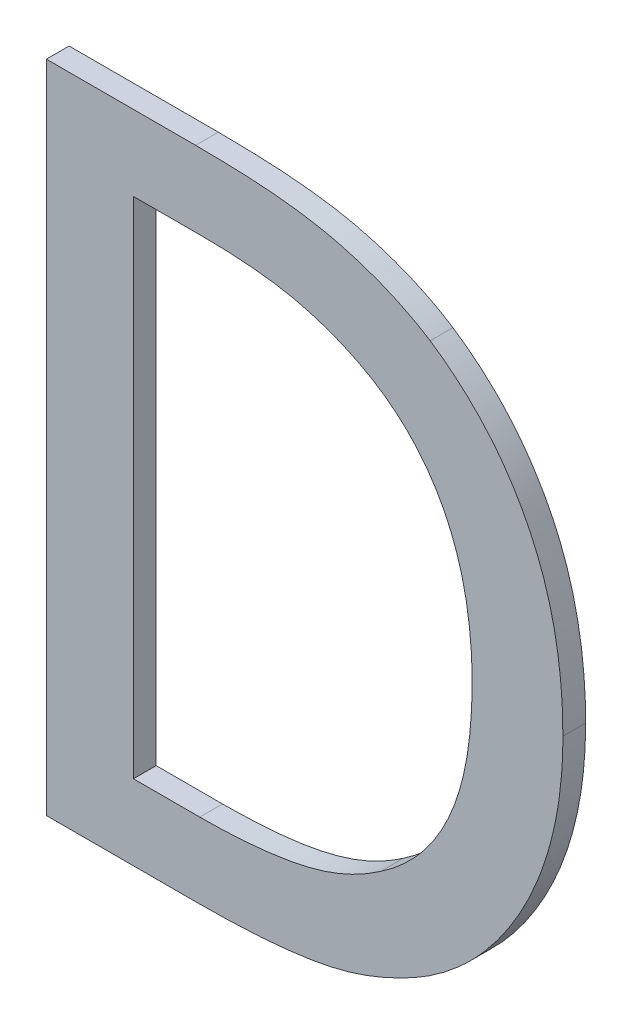
ISO-10303-21;
HEADER;
FILE_DESCRIPTION(('STEP AP214'),'2;1');
FILE_NAME('part.step','',(''),(''),'','','');
FILE_SCHEMA(('AUTOMOTIVE_DESIGN { 1 0 10303 214 1 1 1 1 }'));
ENDSEC;
DATA;
#1=APPLICATION_CONTEXT('core data for automotive mechanical design processes');
#2=APPLICATION_PROTOCOL_DEFINITION('international standard','automotive_design',2000,#1);
#3=PRODUCT_CONTEXT('',#1,'mechanical');
#4=PRODUCT('Part','Part','',(#3));
#5=PRODUCT_RELATED_PRODUCT_CATEGORY('part','',(#4));
#6=PRODUCT_DEFINITION_FORMATION('','',#4);
#7=PRODUCT_DEFINITION_CONTEXT('part definition',#1,'design');
#8=PRODUCT_DEFINITION('design','',#6,#7);
#9=PRODUCT_DEFINITION_SHAPE('','',#8);
#10=(LENGTH_UNIT() NAMED_UNIT(*) SI_UNIT(.MILLI.,.METRE.));
#11=(NAMED_UNIT(*) PLANE_ANGLE_UNIT() SI_UNIT($,.RADIAN.));
#12=(NAMED_UNIT(*) SI_UNIT($,.STERADIAN.) SOLID_ANGLE_UNIT());
#13=UNCERTAINTY_MEASURE_WITH_UNIT(LENGTH_MEASURE(1.E-05),#10,'distance_accuracy_value','');
#14=(GEOMETRIC_REPRESENTATION_CONTEXT(3) GLOBAL_UNCERTAINTY_ASSIGNED_CONTEXT((#13)) GLOBAL_UNIT_ASSIGNED_CONTEXT((#10,
#11,#12)) REPRESENTATION_CONTEXT('',''));
#15=CARTESIAN_POINT('',(0.,0.,0.));
#16=DIRECTION('',(0.,0.,1.));
#17=DIRECTION('',(1.,0.,0.));
#18=AXIS2_PLACEMENT_3D('',#15,#16,#17);
#19=CARTESIAN_POINT('',(-1.13140049899988,-1.31839189230399,0.0042));
#20=DIRECTION('',(0.,0.,1.));
#21=DIRECTION('',(1.,0.,0.));
#22=AXIS2_PLACEMENT_3D('',#19,#20,#21);
#23=PLANE('',#22);
#24=CARTESIAN_POINT('',(-1.10301730747266,-1.35955192614825,0.0042));
#25=CARTESIAN_POINT('',(-1.09960235289576,-1.35729888949205,0.0042));
#26=CARTESIAN_POINT('',(-1.09659369860559,-1.35452542417896,0.0042));
#27=CARTESIAN_POINT('',(-1.09117427078149,-1.34791884180105,0.0042));
#28=CARTESIAN_POINT('',(-1.08886084613736,-1.34400450014259,0.0042));
#29=CARTESIAN_POINT('',(-1.08516833311592,-1.33521081154436,0.0042));
#30=CARTESIAN_POINT('',(-1.08393591014188,-1.3302720120489,0.0042));
#31=CARTESIAN_POINT('',(-1.0831140908516,-1.32301760150182,0.0042));
#32=CARTESIAN_POINT('',(-1.08299402692732,-1.32075138212531,0.0042));
#33=CARTESIAN_POINT('',(-1.08300434203172,-1.31849357860533,0.0042));
#34=B_SPLINE_CURVE_WITH_KNOTS('',3,(#24,#25,#26,#27,#28,#29,#30,#31,#32,#33),.UNSPECIFIED.,.F.,
.F.,(4,2,2,2,4),(0.,0.0121483247201117,0.0255860257724383,0.0406473485388404,0.047434827382608),.UNSPECIFIED.);
#35=CARTESIAN_POINT('',(-1.10301730747266,-1.35955192614825,0.0042));
#36=VERTEX_POINT('',#35);
#37=CARTESIAN_POINT('',(-1.08300434203172,-1.31849358038251,0.0042));
#38=VERTEX_POINT('',#37);
#39=EDGE_CURVE('E11',#36,#38,#34,.T.);
#40=ORIENTED_EDGE('',*,*,#39,.T.);
#41=CARTESIAN_POINT('',(-1.08300434203172,-1.31849358038251,0.0042));
#42=CARTESIAN_POINT('',(-1.08300982933336,-1.31558404365748,0.0042));
#43=CARTESIAN_POINT('',(-1.08316865375619,-1.31265959893963,0.0042));
#44=CARTESIAN_POINT('',(-1.08390324457186,-1.30685151311761,0.0042));
#45=CARTESIAN_POINT('',(-1.08448109847194,-1.3039681502848,0.0042));
#46=CARTESIAN_POINT('',(-1.08659467127721,-1.29691345012609,0.0042));
#47=CARTESIAN_POINT('',(-1.08846808725424,-1.29283291179868,0.0042));
#48=CARTESIAN_POINT('',(-1.09322256029744,-1.28566720024031,0.0042));
#49=CARTESIAN_POINT('',(-1.09603296293457,-1.28253561646582,0.0042));
#50=CARTESIAN_POINT('',(-1.1003891642201,-1.27892416111204,0.0042));
#51=CARTESIAN_POINT('',(-1.10160144533238,-1.27802509561075,0.0042));
#52=CARTESIAN_POINT('',(-1.10285847447021,-1.2771969849906,0.0042));
#53=B_SPLINE_CURVE_WITH_KNOTS('',3,(#41,#42,#43,#44,#45,#46,#47,#48,#49,#50,#51,#52),
.UNSPECIFIED.,.F.,.F.,(4,2,2,2,2,4),(0.,0.00874687254746836,0.0175376219848716,
0.0307994104116767,0.0432285066677304,0.0477472718789346),.UNSPECIFIED.);
#54=CARTESIAN_POINT('',(-1.1028584744136,-1.27719698502818,0.0042));
#55=VERTEX_POINT('',#54);
#56=EDGE_CURVE('E138',#38,#55,#53,.T.);
#57=ORIENTED_EDGE('',*,*,#56,.T.);
#58=CARTESIAN_POINT('',(-1.1028584744136,-1.27719698502818,0.0042));
#59=CARTESIAN_POINT('',(-1.10575896532914,-1.2753338488799,0.0042));
#60=CARTESIAN_POINT('',(-1.10887155015735,-1.27386765144865,0.0042));
#61=CARTESIAN_POINT('',(-1.11500161855721,-1.27173618957782,0.0042));
#62=CARTESIAN_POINT('',(-1.11799509444407,-1.27100327847368,0.0042));
#63=CARTESIAN_POINT('',(-1.1243818689548,-1.26995110489897,0.0042));
#64=CARTESIAN_POINT('',(-1.1277826761789,-1.26968676389934,0.0042));
#65=CARTESIAN_POINT('',(-1.13344695278662,-1.26946475473684,0.0042));
#66=CARTESIAN_POINT('',(-1.13570787886852,-1.26943380337388,0.0042));
#67=CARTESIAN_POINT('',(-1.13796058046478,-1.26941416513448,0.0042));
#68=B_SPLINE_CURVE_WITH_KNOTS('',3,(#58,#59,#60,#61,#62,#63,#64,#65,#66,#67),.UNSPECIFIED.,.F.,
.F.,(4,2,2,2,4),(0.,0.010263633500949,0.0194555388350048,0.0296673672654124,0.0364413513656691),.UNSPECIFIED.);
#69=CARTESIAN_POINT('',(-1.13796058046478,-1.26941416513448,0.0042));
#70=VERTEX_POINT('',#69);
#71=EDGE_CURVE('E270',#55,#70,#68,.T.);
#72=ORIENTED_EDGE('',*,*,#71,.T.);
#73=DIRECTION('',(-1.,0.,0.));
#74=VECTOR('',#73,1.);
#75=CARTESIAN_POINT('',(-1.13796058046478,-1.26941416513448,0.0042));
#76=LINE('',#75,#74);
#77=CARTESIAN_POINT('',(-1.16027662526202,-1.26941416513448,0.0042));
#78=VERTEX_POINT('',#77);
#79=EDGE_CURVE('E262',#70,#78,#76,.T.);
#80=ORIENTED_EDGE('',*,*,#79,.T.);
#81=DIRECTION('',(0.,-1.,0.));
#82=VECTOR('',#81,1.);
#83=CARTESIAN_POINT('',(-1.16027662526202,-1.26941416513448,0.0042));
#84=LINE('',#83,#82);
#85=CARTESIAN_POINT('',(-1.16027662526202,-1.36741416257148,0.0042));
#86=VERTEX_POINT('',#85);
#87=EDGE_CURVE('E327',#78,#86,#84,.T.);
#88=ORIENTED_EDGE('',*,*,#87,.T.);
#89=DIRECTION('',(1.,0.,0.));
#90=VECTOR('',#89,1.);
#91=CARTESIAN_POINT('',(-1.16027662526202,-1.36741416257148,0.0042));
#92=LINE('',#91,#90);
#93=CARTESIAN_POINT('',(-1.1377223308762,-1.36741416257148,0.0042));
#94=VERTEX_POINT('',#93);
#95=EDGE_CURVE('E335',#86,#94,#92,.T.);
#96=ORIENTED_EDGE('',*,*,#95,.T.);
#97=CARTESIAN_POINT('',(-1.1377223308762,-1.36741416257148,0.0042));
#98=CARTESIAN_POINT('',(-1.13500817967669,-1.36740371898884,0.0042));
#99=CARTESIAN_POINT('',(-1.13228524834509,-1.36735083765665,0.0042));
#100=CARTESIAN_POINT('',(-1.12684049036077,-1.36705099203876,0.0042));
#101=CARTESIAN_POINT('',(-1.12411871154517,-1.36680325352465,0.0042));
#102=CARTESIAN_POINT('',(-1.12027061528457,-1.36623303358368,0.0042));
#103=CARTESIAN_POINT('',(-1.11912711970572,-1.36603551380033,0.0042));
#104=CARTESIAN_POINT('',(-1.11727488370886,-1.36564071016203,0.0042));
#105=CARTESIAN_POINT('',(-1.11656058339052,-1.36546993593813,0.0042));
#106=CARTESIAN_POINT('',(-1.11503159663148,-1.36505960509416,0.0042));
#107=CARTESIAN_POINT('',(-1.11421867382135,-1.36481346926531,0.0042));
#108=CARTESIAN_POINT('',(-1.11176310505891,-1.36398964451947,0.0042));
#109=CARTESIAN_POINT('',(-1.11014608236842,-1.36333531324551,0.0042));
#110=CARTESIAN_POINT('',(-1.10665639527216,-1.36169802475253,0.0042));
#111=CARTESIAN_POINT('',(-1.10480235242511,-1.36067479026885,0.0042));
#112=CARTESIAN_POINT('',(-1.10301730746953,-1.35955192614628,0.0042));
#113=B_SPLINE_CURVE_WITH_KNOTS('',3,(#97,#98,#99,#100,#101,#102,#103,#104,#105,#106,#107,#108,
#109,#110,#111,#112),.UNSPECIFIED.,.F.,.F.,(4,2,2,2,2,2,2,4),(0.,0.00815681662447947,
0.0163462075588577,0.0198249701318982,0.022027207716926,0.0245737239404821,0.0297957794660066,
0.036126634845621),.UNSPECIFIED.);
#114=EDGE_CURVE('E379',#94,#36,#113,.T.);
#115=ORIENTED_EDGE('',*,*,#114,.T.);
#116=EDGE_LOOP('',(#40,#57,#72,#80,#88,#96,#115));
#117=FACE_BOUND('',#116,.T.);
#118=CARTESIAN_POINT('',(-1.11024421165967,-1.34962485995731,0.0042));
#119=CARTESIAN_POINT('',(-1.11157203534654,-1.35055736590895,0.0042));
#120=CARTESIAN_POINT('',(-1.11297341778274,-1.35138748820357,0.0042));
#121=CARTESIAN_POINT('',(-1.1158648797809,-1.35281318705049,0.0042));
#122=CARTESIAN_POINT('',(-1.1173533354089,-1.35341205991404,0.0042));
#123=CARTESIAN_POINT('',(-1.12063043563334,-1.3544462784535,0.0042));
#124=CARTESIAN_POINT('',(-1.12243064896194,-1.35484369238719,0.0042));
#125=CARTESIAN_POINT('',(-1.12606463026105,-1.35546234714417,0.0042));
#126=CARTESIAN_POINT('',(-1.12789851434755,-1.3556827706722,0.0042));
#127=CARTESIAN_POINT('',(-1.13100422670817,-1.35594349247601,0.0042));
#128=CARTESIAN_POINT('',(-1.13227321979143,-1.35601850934008,0.0042));
#129=CARTESIAN_POINT('',(-1.13480338399338,-1.35611495032586,0.0042));
#130=CARTESIAN_POINT('',(-1.13606453884867,-1.35613678820967,0.0042));
#131=CARTESIAN_POINT('',(-1.13732524822856,-1.35613701537857,0.0042));
#132=B_SPLINE_CURVE_WITH_KNOTS('',3,(#118,#119,#120,#121,#122,#123,#124,#125,#126,#127,#128,
#129,#130,#131),.UNSPECIFIED.,.F.,.F.,(4,2,2,2,2,2,4),(0.,0.0048656758365212,
0.00965918058658374,0.0151707053628846,0.0207075368628053,0.0245199346406423,0.028302573698393),.UNSPECIFIED.);
#133=CARTESIAN_POINT('',(-1.11024421165967,-1.34962485995731,0.0042));
#134=VERTEX_POINT('',#133);
#135=CARTESIAN_POINT('',(-1.13732524822856,-1.35613701537857,0.0042));
#136=VERTEX_POINT('',#135);
#137=EDGE_CURVE('E222',#134,#136,#132,.T.);
#138=ORIENTED_EDGE('',*,*,#137,.T.);
#139=DIRECTION('',(-1.,0.,0.));
#140=VECTOR('',#139,1.);
#141=CARTESIAN_POINT('',(-1.13732524822856,-1.35613701537857,0.0042));
#142=LINE('',#141,#140);
#143=CARTESIAN_POINT('',(-1.14725231441951,-1.35613701537857,0.0042));
#144=VERTEX_POINT('',#143);
#145=EDGE_CURVE('E269',#136,#144,#142,.T.);
#146=ORIENTED_EDGE('',*,*,#145,.T.);
#147=DIRECTION('',(0.,1.,0.));
#148=VECTOR('',#147,1.);
#149=CARTESIAN_POINT('',(-1.14725231441951,-1.35613701537857,0.0042));
#150=LINE('',#149,#148);
#151=CARTESIAN_POINT('',(-1.14725231441951,-1.28069131232739,0.0042));
#152=VERTEX_POINT('',#151);
#153=EDGE_CURVE('E319',#144,#152,#150,.T.);
#154=ORIENTED_EDGE('',*,*,#153,.T.);
#155=DIRECTION('',(1.,0.,0.));
#156=VECTOR('',#155,1.);
#157=CARTESIAN_POINT('',(-1.14725231441951,-1.28069131232739,0.0042));
#158=LINE('',#157,#156);
#159=CARTESIAN_POINT('',(-1.13732524822856,-1.28069131232739,0.0042));
#160=VERTEX_POINT('',#159);
#161=EDGE_CURVE('E329',#152,#160,#158,.T.);
#162=ORIENTED_EDGE('',*,*,#161,.T.);
#163=CARTESIAN_POINT('',(-1.13732524822856,-1.28069131232739,0.0042));
#164=CARTESIAN_POINT('',(-1.13521678352764,-1.28070898737483,0.0042));
#165=CARTESIAN_POINT('',(-1.13309745103266,-1.28075684530196,0.0042));
#166=CARTESIAN_POINT('',(-1.12886194601626,-1.28103600808401,0.0042));
#167=CARTESIAN_POINT('',(-1.12674584356322,-1.28126823858898,0.0042));
#168=CARTESIAN_POINT('',(-1.1221872235976,-1.28211115314495,0.0042));
#169=CARTESIAN_POINT('',(-1.11975453554178,-1.28278244976374,0.0042));
#170=CARTESIAN_POINT('',(-1.11533840040602,-1.28446528614556,0.0042));
#171=CARTESIAN_POINT('',(-1.1133358164328,-1.28542732691544,0.0042));
#172=CARTESIAN_POINT('',(-1.11143545960227,-1.28656813551261,0.0042));
#173=B_SPLINE_CURVE_WITH_KNOTS('',3,(#163,#164,#165,#166,#167,#168,#169,#170,#171,#172),
.UNSPECIFIED.,.F.,.F.,(4,2,2,2,4),(0.,0.00634351880858543,0.0127190884594158,0.0202425892854986,
0.026878269218333),.UNSPECIFIED.);
#174=CARTESIAN_POINT('',(-1.11143545960258,-1.28656813551243,0.0042));
#175=VERTEX_POINT('',#174);
#176=EDGE_CURVE('E336',#160,#175,#173,.T.);
#177=ORIENTED_EDGE('',*,*,#176,.T.);
#178=CARTESIAN_POINT('',(-1.11143545960258,-1.28656813551243,0.0042));
#179=CARTESIAN_POINT('',(-1.11016657004239,-1.28734298316421,0.0042));
#180=CARTESIAN_POINT('',(-1.10895601342185,-1.28821401576167,0.0042));
#181=CARTESIAN_POINT('',(-1.10668936589985,-1.29012942543853,0.0042));
#182=CARTESIAN_POINT('',(-1.10563268789603,-1.29117310937606,0.0042));
#183=CARTESIAN_POINT('',(-1.10277546676278,-1.29449842369174,0.0042));
#184=CARTESIAN_POINT('',(-1.10123266831576,-1.29700780232448,0.0042));
#185=CARTESIAN_POINT('',(-1.09868703353264,-1.30272181808107,0.0042));
#186=CARTESIAN_POINT('',(-1.09780232662253,-1.30597412992284,0.0042));
#187=CARTESIAN_POINT('',(-1.09678430121129,-1.31228636596024,0.0042));
#188=CARTESIAN_POINT('',(-1.09658807239371,-1.31533556753005,0.0042));
#189=CARTESIAN_POINT('',(-1.09658456858093,-1.31833474732345,0.0042));
#190=B_SPLINE_CURVE_WITH_KNOTS('',3,(#178,#179,#180,#181,#182,#183,#184,#185,#186,#187,#188,
#189),.UNSPECIFIED.,.F.,.F.,(4,2,2,2,2,4),(0.,0.00445608065663681,0.00889468737193858,
0.0175875109740678,0.0276051771161479,0.0366795200492553),.UNSPECIFIED.);
#191=CARTESIAN_POINT('',(-1.09658456858093,-1.31833474732345,0.0042));
#192=VERTEX_POINT('',#191);
#193=EDGE_CURVE('E373',#175,#192,#190,.T.);
#194=ORIENTED_EDGE('',*,*,#193,.T.);
#195=CARTESIAN_POINT('',(-1.09658456858093,-1.31833474732345,0.0042));
#196=CARTESIAN_POINT('',(-1.09659541853067,-1.32063320012037,0.0042));
#197=CARTESIAN_POINT('',(-1.09669148673753,-1.322943179593,0.0042));
#198=CARTESIAN_POINT('',(-1.0971745817959,-1.32756140107349,0.0042));
#199=CARTESIAN_POINT('',(-1.09756551270803,-1.32986920004738,0.0042));
#200=CARTESIAN_POINT('',(-1.09895886146249,-1.33512444451162,0.0042));
#201=CARTESIAN_POINT('',(-1.10011808872536,-1.33803752473386,0.0042));
#202=CARTESIAN_POINT('',(-1.10315327981692,-1.34306488749063,0.0042));
#203=CARTESIAN_POINT('',(-1.10494127230031,-1.34523091410798,0.0042));
#204=CARTESIAN_POINT('',(-1.10801661762171,-1.34801516405458,0.0042));
#205=CARTESIAN_POINT('',(-1.10910286080375,-1.34886363896521,0.0042));
#206=CARTESIAN_POINT('',(-1.11024421171022,-1.3496248599914,0.0042));
#207=B_SPLINE_CURVE_WITH_KNOTS('',3,(#195,#196,#197,#198,#199,#200,#201,#202,#203,#204,#205,
#206),.UNSPECIFIED.,.F.,.F.,(4,2,2,2,2,4),(0.,0.00691079574746498,0.0139147345152009,
0.0231825961663285,0.0314779740292851,0.0355972436315414),.UNSPECIFIED.);
#208=EDGE_CURVE('E253',#192,#134,#207,.T.);
#209=ORIENTED_EDGE('',*,*,#208,.T.);
#210=EDGE_LOOP('',(#138,#146,#154,#162,#177,#194,#209));
#211=FACE_BOUND('',#210,.T.);
#212=ADVANCED_FACE('F17',(#117,#211),#23,.T.);
#213=CARTESIAN_POINT('',(-1.11024421165967,-1.34962485995731,0.0008));
#214=CARTESIAN_POINT('',(-1.11024421165967,-1.34962485995731,0.0042));
#215=CARTESIAN_POINT('',(-1.1034143901203,-1.34501870124471,0.0008));
#216=CARTESIAN_POINT('',(-1.1034143901203,-1.34501870124471,0.0042));
#217=CARTESIAN_POINT('',(-1.09658456858093,-1.32977072757542,0.0008));
#218=CARTESIAN_POINT('',(-1.09658456858093,-1.32977072757542,0.0042));
#219=CARTESIAN_POINT('',(-1.09658456858093,-1.31833474732345,0.0008));
#220=CARTESIAN_POINT('',(-1.09658456858093,-1.31833474732345,0.0042));
#221=B_SPLINE_SURFACE_WITH_KNOTS('',2,1,((#213,#214),(#215,#216),(#217,#218),(#219,#220)),
.UNSPECIFIED.,.F.,.F.,.F.,(3,1,3),(2,2),(0.,0.5,1.),(0.,1.),.UNSPECIFIED.);
#222=CARTESIAN_POINT('',(-1.11024421165967,-1.34962485995731,0.0008));
#223=CARTESIAN_POINT('',(-1.10901210354309,-1.34879731583163,0.0008));
#224=CARTESIAN_POINT('',(-1.10784348992091,-1.34787608623182,0.0008));
#225=CARTESIAN_POINT('',(-1.1056665424074,-1.34586693353079,0.0008));
#226=CARTESIAN_POINT('',(-1.10465773000568,-1.34477952800885,0.0008));
#227=CARTESIAN_POINT('',(-1.10195272590175,-1.34134486653136,0.0008));
#228=CARTESIAN_POINT('',(-1.1005178647497,-1.33878468994247,0.0008));
#229=CARTESIAN_POINT('',(-1.09829789677024,-1.33317723537789,0.0008));
#230=CARTESIAN_POINT('',(-1.09757768121166,-1.3301070936118,0.0008));
#231=CARTESIAN_POINT('',(-1.09675011153146,-1.3241155646116,0.0008));
#232=CARTESIAN_POINT('',(-1.09660045448235,-1.32120053299536,0.0008));
#233=CARTESIAN_POINT('',(-1.09658456858093,-1.31833474732345,0.0008));
#234=B_SPLINE_CURVE_WITH_KNOTS('',3,(#222,#223,#224,#225,#226,#227,#228,#229,#230,#231,#232,
#233),.UNSPECIFIED.,.F.,.F.,(4,2,2,2,2,4),(0.,0.00444696525724402,0.00888035193201221,
0.0175394397206024,0.0269277130966965,0.0356046138722512),.UNSPECIFIED.);
#235=CARTESIAN_POINT('',(-1.11024421165967,-1.34962485995731,0.0008));
#236=VERTEX_POINT('',#235);
#237=CARTESIAN_POINT('',(-1.09658456858093,-1.31833474732345,0.0008));
#238=VERTEX_POINT('',#237);
#239=EDGE_CURVE('E30',#236,#238,#234,.T.);
#240=DIRECTION('',(0.,0.,1.));
#241=VECTOR('',#240,1.);
#242=CARTESIAN_POINT('',(-1.11024421165967,-1.34962485995731,0.0008));
#243=LINE('',#242,#241);
#244=EDGE_CURVE('E223',#236,#134,#243,.T.);
#245=DIRECTION('',(0.,0.,1.));
#246=VECTOR('',#245,1.);
#247=CARTESIAN_POINT('',(-1.09658456858093,-1.31833474732345,0.0008));
#248=LINE('',#247,#246);
#249=EDGE_CURVE('E316',#238,#192,#248,.T.);
#250=ORIENTED_EDGE('',*,*,#239,.F.);
#251=ORIENTED_EDGE('',*,*,#244,.T.);
#252=ORIENTED_EDGE('',*,*,#208,.F.);
#253=ORIENTED_EDGE('',*,*,#249,.F.);
#254=EDGE_LOOP('',(#250,#251,#252,#253));
#255=FACE_BOUND('',#254,.T.);
#256=ADVANCED_FACE('F238',(#255),#221,.F.);
#257=CARTESIAN_POINT('',(-1.13732524822856,-1.35613701537857,0.0008));
#258=CARTESIAN_POINT('',(-1.13732524822856,-1.35613701537857,0.0042));
#259=CARTESIAN_POINT('',(-1.12866884651006,-1.35613701537857,0.0008));
#260=CARTESIAN_POINT('',(-1.12866884651006,-1.35613701537857,0.0042));
#261=CARTESIAN_POINT('',(-1.11556511913801,-1.3533574368451,0.0008));
#262=CARTESIAN_POINT('',(-1.11556511913801,-1.3533574368451,0.0042));
#263=CARTESIAN_POINT('',(-1.11024421165967,-1.34962485995731,0.0008));
#264=CARTESIAN_POINT('',(-1.11024421165967,-1.34962485995731,0.0042));
#265=B_SPLINE_SURFACE_WITH_KNOTS('',2,1,((#257,#258),(#259,#260),(#261,#262),(#263,#264)),
.UNSPECIFIED.,.F.,.F.,.F.,(3,1,3),(2,2),(0.,0.5,1.),(0.,1.),.UNSPECIFIED.);
#266=CARTESIAN_POINT('',(-1.13732524822856,-1.35613701537857,0.0008));
#267=CARTESIAN_POINT('',(-1.13481146484368,-1.35610829826261,0.0008));
#268=CARTESIAN_POINT('',(-1.13227893778873,-1.356037108672,0.0008));
#269=CARTESIAN_POINT('',(-1.12718838636908,-1.35563680674605,0.0008));
#270=CARTESIAN_POINT('',(-1.12463080328733,-1.35530277836508,0.0008));
#271=CARTESIAN_POINT('',(-1.12047860661542,-1.3543851463183,0.0008));
#272=CARTESIAN_POINT('',(-1.11885881966462,-1.35392896876467,0.0008));
#273=CARTESIAN_POINT('',(-1.11572639316714,-1.35275933856748,0.0008));
#274=CARTESIAN_POINT('',(-1.11421304886994,-1.35204781651545,0.0008));
#275=CARTESIAN_POINT('',(-1.1119002392996,-1.35072962838156,0.0008));
#276=CARTESIAN_POINT('',(-1.11105844117326,-1.35019587305714,0.0008));
#277=CARTESIAN_POINT('',(-1.11024421162105,-1.34962485993022,0.0008));
#278=B_SPLINE_CURVE_WITH_KNOTS('',3,(#266,#267,#268,#269,#270,#271,#272,#273,#274,#275,#276,
#277),.UNSPECIFIED.,.F.,.F.,(4,2,2,2,2,4),(0.,0.00757330339780005,0.0152917225642758,
0.0203221829790827,0.0253153841571827,0.0283004845520568),.UNSPECIFIED.);
#279=CARTESIAN_POINT('',(-1.13732524822856,-1.35613701537857,0.0008));
#280=VERTEX_POINT('',#279);
#281=EDGE_CURVE('E214',#280,#236,#278,.T.);
#282=DIRECTION('',(0.,0.,1.));
#283=VECTOR('',#282,1.);
#284=CARTESIAN_POINT('',(-1.13732524822856,-1.35613701537857,0.0008));
#285=LINE('',#284,#283);
#286=EDGE_CURVE('E261',#280,#136,#285,.T.);
#287=ORIENTED_EDGE('',*,*,#281,.F.);
#288=ORIENTED_EDGE('',*,*,#286,.T.);
#289=ORIENTED_EDGE('',*,*,#137,.F.);
#290=ORIENTED_EDGE('',*,*,#244,.F.);
#291=EDGE_LOOP('',(#287,#288,#289,#290));
#292=FACE_BOUND('',#291,.T.);
#293=ADVANCED_FACE('F165',(#292),#265,.F.);
#294=CARTESIAN_POINT('',(-1.14725231441951,-1.35613701537857,0.0008));
#295=DIRECTION('',(0.,-1.,0.));
#296=DIRECTION('',(1.,0.,0.));
#297=AXIS2_PLACEMENT_3D('',#294,#295,#296);
#298=PLANE('',#297);
#299=DIRECTION('',(1.,0.,0.));
#300=VECTOR('',#299,1.);
#301=CARTESIAN_POINT('',(-1.14725231441951,-1.35613701537857,0.0008));
#302=LINE('',#301,#300);
#303=CARTESIAN_POINT('',(-1.14725231441951,-1.35613701537857,0.0008));
#304=VERTEX_POINT('',#303);
#305=EDGE_CURVE('E266',#304,#280,#302,.T.);
#306=ORIENTED_EDGE('',*,*,#305,.F.);
#307=DIRECTION('',(0.,0.,1.));
#308=VECTOR('',#307,1.);
#309=CARTESIAN_POINT('',(-1.14725231441951,-1.35613701537857,0.0008));
#310=LINE('',#309,#308);
#311=EDGE_CURVE('E312',#304,#144,#310,.T.);
#312=ORIENTED_EDGE('',*,*,#311,.T.);
#313=ORIENTED_EDGE('',*,*,#145,.F.);
#314=ORIENTED_EDGE('',*,*,#286,.F.);
#315=EDGE_LOOP('',(#306,#312,#313,#314));
#316=FACE_BOUND('',#315,.T.);
#317=ADVANCED_FACE('F285',(#316),#298,.F.);
#318=CARTESIAN_POINT('',(-1.14725231441951,-1.28069131232739,0.0008));
#319=DIRECTION('',(-1.,0.,0.));
#320=DIRECTION('',(0.,-1.,0.));
#321=AXIS2_PLACEMENT_3D('',#318,#319,#320);
#322=PLANE('',#321);
#323=DIRECTION('',(0.,-1.,0.));
#324=VECTOR('',#323,1.);
#325=CARTESIAN_POINT('',(-1.14725231441951,-1.28069131232739,0.0008));
#326=LINE('',#325,#324);
#327=CARTESIAN_POINT('',(-1.14725231441951,-1.28069131232739,0.0008));
#328=VERTEX_POINT('',#327);
#329=EDGE_CURVE('E315',#328,#304,#326,.T.);
#330=ORIENTED_EDGE('',*,*,#329,.F.);
#331=DIRECTION('',(0.,0.,1.));
#332=VECTOR('',#331,1.);
#333=CARTESIAN_POINT('',(-1.14725231441951,-1.28069131232739,0.0008));
#334=LINE('',#333,#332);
#335=EDGE_CURVE('E321',#328,#152,#334,.T.);
#336=ORIENTED_EDGE('',*,*,#335,.T.);
#337=ORIENTED_EDGE('',*,*,#153,.F.);
#338=ORIENTED_EDGE('',*,*,#311,.F.);
#339=EDGE_LOOP('',(#330,#336,#337,#338));
#340=FACE_BOUND('',#339,.T.);
#341=ADVANCED_FACE('F283',(#340),#322,.F.);
#342=CARTESIAN_POINT('',(-1.13732524822856,-1.28069131232739,0.0008));
#343=DIRECTION('',(0.,1.,0.));
#344=DIRECTION('',(-1.,0.,0.));
#345=AXIS2_PLACEMENT_3D('',#342,#343,#344);
#346=PLANE('',#345);
#347=DIRECTION('',(-1.,0.,0.));
#348=VECTOR('',#347,1.);
#349=CARTESIAN_POINT('',(-1.13732524822856,-1.28069131232739,0.0008));
#350=LINE('',#349,#348);
#351=CARTESIAN_POINT('',(-1.13732524822856,-1.28069131232739,0.0008));
#352=VERTEX_POINT('',#351);
#353=EDGE_CURVE('E331',#352,#328,#350,.T.);
#354=ORIENTED_EDGE('',*,*,#353,.F.);
#355=DIRECTION('',(0.,0.,1.));
#356=VECTOR('',#355,1.);
#357=CARTESIAN_POINT('',(-1.13732524822856,-1.28069131232739,0.0008));
#358=LINE('',#357,#356);
#359=EDGE_CURVE('E384',#352,#160,#358,.T.);
#360=ORIENTED_EDGE('',*,*,#359,.T.);
#361=ORIENTED_EDGE('',*,*,#161,.F.);
#362=ORIENTED_EDGE('',*,*,#335,.F.);
#363=EDGE_LOOP('',(#354,#360,#361,#362));
#364=FACE_BOUND('',#363,.T.);
#365=ADVANCED_FACE('F299',(#364),#346,.F.);
#366=CARTESIAN_POINT('',(-1.11143545960258,-1.28656813551243,0.0008));
#367=CARTESIAN_POINT('',(-1.11143545960258,-1.28656813551243,0.0042));
#368=CARTESIAN_POINT('',(-1.1166769505514,-1.28347089086086,0.0008));
#369=CARTESIAN_POINT('',(-1.1166769505514,-1.28347089086086,0.0042));
#370=CARTESIAN_POINT('',(-1.128510013451,-1.28069131232739,0.0008));
#371=CARTESIAN_POINT('',(-1.128510013451,-1.28069131232739,0.0042));
#372=CARTESIAN_POINT('',(-1.13732524822856,-1.28069131232739,0.0008));
#373=CARTESIAN_POINT('',(-1.13732524822856,-1.28069131232739,0.0042));
#374=B_SPLINE_SURFACE_WITH_KNOTS('',2,1,((#366,#367),(#368,#369),(#370,#371),(#372,#373)),
.UNSPECIFIED.,.F.,.F.,.F.,(3,1,3),(2,2),(0.,0.5,1.),(0.,1.),.UNSPECIFIED.);
#375=CARTESIAN_POINT('',(-1.11143545960258,-1.28656813551243,0.0008));
#376=CARTESIAN_POINT('',(-1.11317535881473,-1.28553492719357,0.0008));
#377=CARTESIAN_POINT('',(-1.11499776629571,-1.28463801470656,0.0008));
#378=CARTESIAN_POINT('',(-1.11873480005457,-1.28314094629886,0.0008));
#379=CARTESIAN_POINT('',(-1.12064802366197,-1.28253729067655,0.0008));
#380=CARTESIAN_POINT('',(-1.12515078078751,-1.28148144249925,0.0008));
#381=CARTESIAN_POINT('',(-1.12776377802727,-1.28113659111453,0.0008));
#382=CARTESIAN_POINT('',(-1.13270154423831,-1.28076639331707,0.0008));
#383=CARTESIAN_POINT('',(-1.13502360365142,-1.28070790493581,0.0008));
#384=CARTESIAN_POINT('',(-1.13732524822856,-1.28069131232739,0.0008));
#385=B_SPLINE_CURVE_WITH_KNOTS('',3,(#375,#376,#377,#378,#379,#380,#381,#382,#383,#384),
.UNSPECIFIED.,.F.,.F.,(4,2,2,2,4),(0.,0.00606786082259781,0.0120614118443953,0.0199399155597757,
0.0268807340708636),.UNSPECIFIED.);
#386=CARTESIAN_POINT('',(-1.11143545960258,-1.28656813551243,0.0008));
#387=VERTEX_POINT('',#386);
#388=EDGE_CURVE('E205',#387,#352,#385,.T.);
#389=DIRECTION('',(0.,0.,1.));
#390=VECTOR('',#389,1.);
#391=CARTESIAN_POINT('',(-1.11143545960258,-1.28656813551243,0.0008));
#392=LINE('',#391,#390);
#393=EDGE_CURVE('E405',#387,#175,#392,.T.);
#394=ORIENTED_EDGE('',*,*,#388,.F.);
#395=ORIENTED_EDGE('',*,*,#393,.T.);
#396=ORIENTED_EDGE('',*,*,#176,.F.);
#397=ORIENTED_EDGE('',*,*,#359,.F.);
#398=EDGE_LOOP('',(#394,#395,#396,#397));
#399=FACE_BOUND('',#398,.T.);
#400=ADVANCED_FACE('F341',(#399),#374,.F.);
#401=CARTESIAN_POINT('',(-1.09658456858093,-1.31833474732345,0.0008));
#402=CARTESIAN_POINT('',(-1.09658456858093,-1.31833474732345,0.0042));
#403=CARTESIAN_POINT('',(-1.09658456858093,-1.30705760013054,0.0008));
#404=CARTESIAN_POINT('',(-1.09658456858093,-1.30705760013054,0.0042));
#405=CARTESIAN_POINT('',(-1.10404972235652,-1.2910948776955,0.0008));
#406=CARTESIAN_POINT('',(-1.10404972235652,-1.2910948776955,0.0042));
#407=CARTESIAN_POINT('',(-1.11143545960258,-1.28656813551243,0.0008));
#408=CARTESIAN_POINT('',(-1.11143545960258,-1.28656813551243,0.0042));
#409=B_SPLINE_SURFACE_WITH_KNOTS('',2,1,((#401,#402),(#403,#404),(#405,#406),(#407,#408)),
.UNSPECIFIED.,.F.,.F.,.F.,(3,1,3),(2,2),(0.,0.5,1.),(0.,1.),.UNSPECIFIED.);
#410=CARTESIAN_POINT('',(-1.09658456858093,-1.31833474732345,0.0008));
#411=CARTESIAN_POINT('',(-1.09655472226166,-1.31373412756561,0.0008));
#412=CARTESIAN_POINT('',(-1.09705286388688,-1.3089090273319,0.0008));
#413=CARTESIAN_POINT('',(-1.09927217750477,-1.30116372591786,0.0008));
#414=CARTESIAN_POINT('',(-1.10058087943368,-1.29810678884575,0.0008));
#415=CARTESIAN_POINT('',(-1.10396067539645,-1.29292836038448,0.0008));
#416=CARTESIAN_POINT('',(-1.10591927419124,-1.29073824325286,0.0008));
#417=CARTESIAN_POINT('',(-1.10919092145564,-1.28804151854473,0.0008));
#418=CARTESIAN_POINT('',(-1.11028872250382,-1.28726110732548,0.0008));
#419=CARTESIAN_POINT('',(-1.11143545964643,-1.28656813548555,0.0008));
#420=B_SPLINE_CURVE_WITH_KNOTS('',3,(#410,#411,#412,#413,#414,#415,#416,#417,#418,#419),
.UNSPECIFIED.,.F.,.F.,(4,2,2,2,4),(0.,0.0140951624618586,0.0239550329766282,0.0326119566053563,
0.0366373251747543),.UNSPECIFIED.);
#421=EDGE_CURVE('E197',#238,#387,#420,.T.);
#422=ORIENTED_EDGE('',*,*,#421,.F.);
#423=ORIENTED_EDGE('',*,*,#249,.T.);
#424=ORIENTED_EDGE('',*,*,#193,.F.);
#425=ORIENTED_EDGE('',*,*,#393,.F.);
#426=EDGE_LOOP('',(#422,#423,#424,#425));
#427=FACE_BOUND('',#426,.T.);
#428=ADVANCED_FACE('F348',(#427),#409,.F.);
#429=CARTESIAN_POINT('',(-1.1377223308762,-1.36741416257148,0.0008));
#430=CARTESIAN_POINT('',(-1.1377223308762,-1.36741416257148,0.0042));
#431=CARTESIAN_POINT('',(-1.12580985144707,-1.36741416257148,0.0008));
#432=CARTESIAN_POINT('',(-1.12580985144707,-1.36741416257148,0.0042));
#433=CARTESIAN_POINT('',(-1.11048246124825,-1.36423750139038,0.0008));
#434=CARTESIAN_POINT('',(-1.11048246124825,-1.36423750139038,0.0042));
#435=CARTESIAN_POINT('',(-1.10301730747266,-1.35955192614825,0.0008));
#436=CARTESIAN_POINT('',(-1.10301730747266,-1.35955192614825,0.0042));
#437=B_SPLINE_SURFACE_WITH_KNOTS('',2,1,((#429,#430),(#431,#432),(#433,#434),(#435,#436)),
.UNSPECIFIED.,.F.,.F.,.F.,(3,1,3),(2,2),(0.,0.5,1.),(0.,1.),.UNSPECIFIED.);
#438=CARTESIAN_POINT('',(-1.10301730747266,-1.35955192614825,0.0008));
#439=CARTESIAN_POINT('',(-1.10503322107486,-1.36081986633529,0.0008));
#440=CARTESIAN_POINT('',(-1.10714249180237,-1.36196398893979,0.0008));
#441=CARTESIAN_POINT('',(-1.11149544594457,-1.36391525508977,0.0008));
#442=CARTESIAN_POINT('',(-1.11373829602534,-1.36472427948599,0.0008));
#443=CARTESIAN_POINT('',(-1.11678430821511,-1.36552567169899,0.0008));
#444=CARTESIAN_POINT('',(-1.11754014386856,-1.36570115244078,0.0008));
#445=CARTESIAN_POINT('',(-1.11904368432538,-1.3660104598308,0.0008));
#446=CARTESIAN_POINT('',(-1.1197912287804,-1.3661450805829,0.0008));
#447=CARTESIAN_POINT('',(-1.12145983576067,-1.36641555622508,0.0008));
#448=CARTESIAN_POINT('',(-1.12238194882611,-1.36654482032121,0.0008));
#449=CARTESIAN_POINT('',(-1.1253594217979,-1.3669093907463,0.0008));
#450=CARTESIAN_POINT('',(-1.12742225402924,-1.36708118175552,0.0008));
#451=CARTESIAN_POINT('',(-1.13223126204267,-1.36735005410692,0.0008));
#452=CARTESIAN_POINT('',(-1.13498023000987,-1.36740431219185,0.0008));
#453=CARTESIAN_POINT('',(-1.1377223308762,-1.36741416257148,0.0008));
#454=B_SPLINE_CURVE_WITH_KNOTS('',3,(#438,#439,#440,#441,#442,#443,#444,#445,#446,#447,#448,
#449,#450,#451,#452,#453),.UNSPECIFIED.,.F.,.F.,(4,2,2,2,2,2,2,4),(0.,0.00716132773031819,
0.0142818968481136,0.0166085893118596,0.0188866413559735,0.0216792969342299,0.0278855211183284,
0.0361219686608558),.UNSPECIFIED.);
#455=CARTESIAN_POINT('',(-1.10301730747266,-1.35955192614825,0.0008));
#456=VERTEX_POINT('',#455);
#457=CARTESIAN_POINT('',(-1.1377223308762,-1.36741416257148,0.0008));
#458=VERTEX_POINT('',#457);
#459=EDGE_CURVE('E187',#456,#458,#454,.T.);
#460=DIRECTION('',(0.,0.,1.));
#461=VECTOR('',#460,1.);
#462=CARTESIAN_POINT('',(-1.10301730747266,-1.35955192614825,0.0008));
#463=LINE('',#462,#461);
#464=EDGE_CURVE('E126',#456,#36,#463,.T.);
#465=DIRECTION('',(0.,0.,1.));
#466=VECTOR('',#465,1.);
#467=CARTESIAN_POINT('',(-1.1377223308762,-1.36741416257148,0.0008));
#468=LINE('',#467,#466);
#469=EDGE_CURVE('E403',#458,#94,#468,.T.);
#470=ORIENTED_EDGE('',*,*,#459,.F.);
#471=ORIENTED_EDGE('',*,*,#464,.T.);
#472=ORIENTED_EDGE('',*,*,#114,.F.);
#473=ORIENTED_EDGE('',*,*,#469,.F.);
#474=EDGE_LOOP('',(#470,#471,#472,#473));
#475=FACE_BOUND('',#474,.T.);
#476=ADVANCED_FACE('F365',(#475),#437,.T.);
#477=CARTESIAN_POINT('',(-1.16027662526202,-1.36741416257148,0.0008));
#478=DIRECTION('',(0.,-1.,0.));
#479=DIRECTION('',(1.,0.,0.));
#480=AXIS2_PLACEMENT_3D('',#477,#478,#479);
#481=PLANE('',#480);
#482=DIRECTION('',(-1.,0.,0.));
#483=VECTOR('',#482,1.);
#484=CARTESIAN_POINT('',(-1.1377223308762,-1.36741416257148,0.0008));
#485=LINE('',#484,#483);
#486=CARTESIAN_POINT('',(-1.16027662526202,-1.36741416257148,0.0008));
#487=VERTEX_POINT('',#486);
#488=EDGE_CURVE('E406',#458,#487,#485,.T.);
#489=ORIENTED_EDGE('',*,*,#488,.F.);
#490=ORIENTED_EDGE('',*,*,#469,.T.);
#491=ORIENTED_EDGE('',*,*,#95,.F.);
#492=DIRECTION('',(0.,0.,1.));
#493=VECTOR('',#492,1.);
#494=CARTESIAN_POINT('',(-1.16027662526202,-1.36741416257148,0.0008));
#495=LINE('',#494,#493);
#496=EDGE_CURVE('E415',#487,#86,#495,.T.);
#497=ORIENTED_EDGE('',*,*,#496,.F.);
#498=EDGE_LOOP('',(#489,#490,#491,#497));
#499=FACE_BOUND('',#498,.T.);
#500=ADVANCED_FACE('F350',(#499),#481,.T.);
#501=CARTESIAN_POINT('',(-1.16027662526202,-1.26941416513448,0.0008));
#502=DIRECTION('',(-1.,0.,0.));
#503=DIRECTION('',(0.,-1.,0.));
#504=AXIS2_PLACEMENT_3D('',#501,#502,#503);
#505=PLANE('',#504);
#506=DIRECTION('',(0.,1.,0.));
#507=VECTOR('',#506,1.);
#508=CARTESIAN_POINT('',(-1.16027662526202,-1.36741416257148,0.0008));
#509=LINE('',#508,#507);
#510=CARTESIAN_POINT('',(-1.16027662526202,-1.26941416513448,0.0008));
#511=VERTEX_POINT('',#510);
#512=EDGE_CURVE('E409',#487,#511,#509,.T.);
#513=ORIENTED_EDGE('',*,*,#512,.F.);
#514=ORIENTED_EDGE('',*,*,#496,.T.);
#515=ORIENTED_EDGE('',*,*,#87,.F.);
#516=DIRECTION('',(0.,0.,1.));
#517=VECTOR('',#516,1.);
#518=CARTESIAN_POINT('',(-1.16027662526202,-1.26941416513448,0.0008));
#519=LINE('',#518,#517);
#520=EDGE_CURVE('E145',#511,#78,#519,.T.);
#521=ORIENTED_EDGE('',*,*,#520,.F.);
#522=EDGE_LOOP('',(#513,#514,#515,#521));
#523=FACE_BOUND('',#522,.T.);
#524=ADVANCED_FACE('F351',(#523),#505,.T.);
#525=CARTESIAN_POINT('',(-1.13796058046478,-1.26941416513448,0.0008));
#526=DIRECTION('',(0.,1.,0.));
#527=DIRECTION('',(-1.,0.,0.));
#528=AXIS2_PLACEMENT_3D('',#525,#526,#527);
#529=PLANE('',#528);
#530=DIRECTION('',(1.,0.,0.));
#531=VECTOR('',#530,1.);
#532=CARTESIAN_POINT('',(-1.16027662526202,-1.26941416513448,0.0008));
#533=LINE('',#532,#531);
#534=CARTESIAN_POINT('',(-1.13796058046478,-1.26941416513448,0.0008));
#535=VERTEX_POINT('',#534);
#536=EDGE_CURVE('E414',#511,#535,#533,.T.);
#537=ORIENTED_EDGE('',*,*,#536,.F.);
#538=ORIENTED_EDGE('',*,*,#520,.T.);
#539=ORIENTED_EDGE('',*,*,#79,.F.);
#540=DIRECTION('',(0.,0.,1.));
#541=VECTOR('',#540,1.);
#542=CARTESIAN_POINT('',(-1.13796058046478,-1.26941416513448,0.0008));
#543=LINE('',#542,#541);
#544=EDGE_CURVE('E130',#535,#70,#543,.T.);
#545=ORIENTED_EDGE('',*,*,#544,.F.);
#546=EDGE_LOOP('',(#537,#538,#539,#545));
#547=FACE_BOUND('',#546,.T.);
#548=ADVANCED_FACE('F281',(#547),#529,.T.);
#549=CARTESIAN_POINT('',(-1.1028584744136,-1.27719698502818,0.0008));
#550=CARTESIAN_POINT('',(-1.1028584744136,-1.27719698502818,0.0042));
#551=CARTESIAN_POINT('',(-1.10841763148053,-1.27354382466991,0.0008));
#552=CARTESIAN_POINT('',(-1.10841763148053,-1.27354382466991,0.0042));
#553=CARTESIAN_POINT('',(-1.12414210432699,-1.26941416513448,0.0008));
#554=CARTESIAN_POINT('',(-1.12414210432699,-1.26941416513448,0.0042));
#555=CARTESIAN_POINT('',(-1.13796058046478,-1.26941416513448,0.0008));
#556=CARTESIAN_POINT('',(-1.13796058046478,-1.26941416513448,0.0042));
#557=B_SPLINE_SURFACE_WITH_KNOTS('',2,1,((#549,#550),(#551,#552),(#553,#554),(#555,#556)),
.UNSPECIFIED.,.F.,.F.,.F.,(3,1,3),(2,2),(0.,0.5,1.),(0.,1.),.UNSPECIFIED.);
#558=CARTESIAN_POINT('',(-1.13796058046478,-1.26941416513448,0.0008));
#559=CARTESIAN_POINT('',(-1.13533146319373,-1.26942529502257,0.0008));
#560=CARTESIAN_POINT('',(-1.1326951828411,-1.2694722320694,0.0008));
#561=CARTESIAN_POINT('',(-1.1274215938807,-1.2697430846468,0.0008));
#562=CARTESIAN_POINT('',(-1.12478432920598,-1.26996775712591,0.0008));
#563=CARTESIAN_POINT('',(-1.12077642793009,-1.27052877988492,0.0008));
#564=CARTESIAN_POINT('',(-1.11939313125908,-1.27076298925129,0.0008));
#565=CARTESIAN_POINT('',(-1.1166569398371,-1.2713609379073,0.0008));
#566=CARTESIAN_POINT('',(-1.11530401465439,-1.27172454076777,0.0008));
#567=CARTESIAN_POINT('',(-1.11165408934192,-1.27284784673241,0.0008));
#568=CARTESIAN_POINT('',(-1.10938408102927,-1.27370356317337,0.0008));
#569=CARTESIAN_POINT('',(-1.10570772581899,-1.27547014431654,0.0008));
#570=CARTESIAN_POINT('',(-1.10425249037148,-1.27628092871192,0.0008));
#571=CARTESIAN_POINT('',(-1.1028584744136,-1.27719698502818,0.0008));
#572=B_SPLINE_CURVE_WITH_KNOTS('',3,(#558,#559,#560,#561,#562,#563,#564,#565,#566,#567,#568,
#569,#570,#571),.UNSPECIFIED.,.F.,.F.,(4,2,2,2,2,2,4),(0.,0.00789892207381993,
0.0158316667636553,0.0200354761184019,0.0242348661537511,0.0314801126748383,0.0364700723228688),.UNSPECIFIED.);
#573=CARTESIAN_POINT('',(-1.1028584744136,-1.27719698502818,0.0008));
#574=VERTEX_POINT('',#573);
#575=EDGE_CURVE('E144',#535,#574,#572,.T.);
#576=DIRECTION('',(0.,0.,1.));
#577=VECTOR('',#576,1.);
#578=CARTESIAN_POINT('',(-1.1028584744136,-1.27719698502818,0.0008));
#579=LINE('',#578,#577);
#580=EDGE_CURVE('E131',#574,#55,#579,.T.);
#581=ORIENTED_EDGE('',*,*,#575,.F.);
#582=ORIENTED_EDGE('',*,*,#544,.T.);
#583=ORIENTED_EDGE('',*,*,#71,.F.);
#584=ORIENTED_EDGE('',*,*,#580,.F.);
#585=EDGE_LOOP('',(#581,#582,#583,#584));
#586=FACE_BOUND('',#585,.T.);
#587=ADVANCED_FACE('F275',(#586),#557,.T.);
#588=CARTESIAN_POINT('',(-1.08300434203172,-1.31849358038251,0.0008));
#589=CARTESIAN_POINT('',(-1.08300434203172,-1.31849358038251,0.0042));
#590=CARTESIAN_POINT('',(-1.08300434203172,-1.30419860506755,0.0008));
#591=CARTESIAN_POINT('',(-1.08300434203172,-1.30419860506755,0.0042));
#592=CARTESIAN_POINT('',(-1.09340790739983,-1.28347089086086,0.0008));
#593=CARTESIAN_POINT('',(-1.09340790739983,-1.28347089086086,0.0042));
#594=CARTESIAN_POINT('',(-1.1028584744136,-1.27719698502818,0.0008));
#595=CARTESIAN_POINT('',(-1.1028584744136,-1.27719698502818,0.0042));
#596=B_SPLINE_SURFACE_WITH_KNOTS('',2,1,((#588,#589),(#590,#591),(#592,#593),(#594,#595)),
.UNSPECIFIED.,.F.,.F.,.F.,(3,1,3),(2,2),(0.,0.5,1.),(0.,1.),.UNSPECIFIED.);
#597=CARTESIAN_POINT('',(-1.1028584744136,-1.27719698502818,0.0008));
#598=CARTESIAN_POINT('',(-1.09919340197667,-1.2795824492933,0.0008));
#599=CARTESIAN_POINT('',(-1.09595310090813,-1.28257002751087,0.0008));
#600=CARTESIAN_POINT('',(-1.09052361305112,-1.28934653233256,0.0008));
#601=CARTESIAN_POINT('',(-1.08832587639179,-1.29312856023984,0.0008));
#602=CARTESIAN_POINT('',(-1.08501235110824,-1.30140227682915,0.0008));
#603=CARTESIAN_POINT('',(-1.0839756259474,-1.30592402628441,0.0008));
#604=CARTESIAN_POINT('',(-1.08313770909796,-1.31315837146778,0.0008));
#605=CARTESIAN_POINT('',(-1.08300130818661,-1.31583768495776,0.0008));
#606=CARTESIAN_POINT('',(-1.08300434203172,-1.31849358038526,0.0008));
#607=B_SPLINE_CURVE_WITH_KNOTS('',3,(#597,#598,#599,#600,#601,#602,#603,#604,#605,#606),
.UNSPECIFIED.,.F.,.F.,(4,2,2,2,4),(0.,0.013029778161204,0.0259507708937236,0.0397064419119227,
0.0477160809104185),.UNSPECIFIED.);
#608=CARTESIAN_POINT('',(-1.08300434203172,-1.31849358038251,0.0008));
#609=VERTEX_POINT('',#608);
#610=EDGE_CURVE('E136',#574,#609,#607,.T.);
#611=DIRECTION('',(0.,0.,1.));
#612=VECTOR('',#611,1.);
#613=CARTESIAN_POINT('',(-1.08300434203172,-1.31849358038251,0.0008));
#614=LINE('',#613,#612);
#615=EDGE_CURVE('E123',#609,#38,#614,.T.);
#616=ORIENTED_EDGE('',*,*,#610,.F.);
#617=ORIENTED_EDGE('',*,*,#580,.T.);
#618=ORIENTED_EDGE('',*,*,#56,.F.);
#619=ORIENTED_EDGE('',*,*,#615,.F.);
#620=EDGE_LOOP('',(#616,#617,#618,#619));
#621=FACE_BOUND('',#620,.T.);
#622=ADVANCED_FACE('F134',(#621),#596,.T.);
#623=CARTESIAN_POINT('',(-1.10301730747266,-1.35955192614825,0.0008));
#624=CARTESIAN_POINT('',(-1.10301730747266,-1.35955192614825,0.0042));
#625=CARTESIAN_POINT('',(-1.09388440657699,-1.35351626990416,0.0008));
#626=CARTESIAN_POINT('',(-1.09388440657699,-1.35351626990416,0.0042));
#627=CARTESIAN_POINT('',(-1.08300434203172,-1.33191497387266,0.0008));
#628=CARTESIAN_POINT('',(-1.08300434203172,-1.33191497387266,0.0042));
#629=CARTESIAN_POINT('',(-1.08300434203172,-1.31849358038251,0.0008));
#630=CARTESIAN_POINT('',(-1.08300434203172,-1.31849358038251,0.0042));
#631=B_SPLINE_SURFACE_WITH_KNOTS('',2,1,((#623,#624),(#625,#626),(#627,#628),(#629,#630)),
.UNSPECIFIED.,.F.,.F.,.F.,(3,1,3),(2,2),(0.,0.5,1.),(0.,1.),.UNSPECIFIED.);
#632=CARTESIAN_POINT('',(-1.08300434203172,-1.31849358038251,0.0008));
#633=CARTESIAN_POINT('',(-1.08299940612818,-1.32135460296973,0.0008));
#634=CARTESIAN_POINT('',(-1.08318889461235,-1.32421958007177,0.0008));
#635=CARTESIAN_POINT('',(-1.08400269052751,-1.32989941486601,0.0008));
#636=CARTESIAN_POINT('',(-1.08462903200576,-1.33271397467284,0.0008));
#637=CARTESIAN_POINT('',(-1.08696718502381,-1.34011903719521,0.0008));
#638=CARTESIAN_POINT('',(-1.08913113289764,-1.34458158600028,0.0008));
#639=CARTESIAN_POINT('',(-1.0934119682744,-1.35073975375886,0.0008));
#640=CARTESIAN_POINT('',(-1.0950817545236,-1.35275631618256,0.0008));
#641=CARTESIAN_POINT('',(-1.09878109089722,-1.35644339818852,0.0008));
#642=CARTESIAN_POINT('',(-1.10081234443709,-1.35811219432871,0.0008));
#643=CARTESIAN_POINT('',(-1.10301730747864,-1.3595519261522,0.0008));
#644=B_SPLINE_CURVE_WITH_KNOTS('',3,(#632,#633,#634,#635,#636,#637,#638,#639,#640,#641,#642,
#643),.UNSPECIFIED.,.F.,.F.,(4,2,2,2,2,4),(0.,0.00857962150463772,0.0171994599260519,
0.031821088929372,0.0396355957650144,0.0474879537898065),.UNSPECIFIED.);
#645=EDGE_CURVE('E120',#609,#456,#644,.T.);
#646=ORIENTED_EDGE('',*,*,#645,.F.);
#647=ORIENTED_EDGE('',*,*,#615,.T.);
#648=ORIENTED_EDGE('',*,*,#39,.F.);
#649=ORIENTED_EDGE('',*,*,#464,.F.);
#650=EDGE_LOOP('',(#646,#647,#648,#649));
#651=FACE_BOUND('',#650,.T.);
#652=ADVANCED_FACE('F122',(#651),#631,.T.);
#653=CARTESIAN_POINT('',(-1.13140049899988,-1.31839189230399,0.0008));
#654=DIRECTION('',(0.,0.,1.));
#655=DIRECTION('',(1.,0.,0.));
#656=AXIS2_PLACEMENT_3D('',#653,#654,#655);
#657=PLANE('',#656);
#658=ORIENTED_EDGE('',*,*,#645,.T.);
#659=ORIENTED_EDGE('',*,*,#459,.T.);
#660=ORIENTED_EDGE('',*,*,#488,.T.);
#661=ORIENTED_EDGE('',*,*,#512,.T.);
#662=ORIENTED_EDGE('',*,*,#536,.T.);
#663=ORIENTED_EDGE('',*,*,#575,.T.);
#664=ORIENTED_EDGE('',*,*,#610,.T.);
#665=EDGE_LOOP('',(#658,#659,#660,#661,#662,#663,#664));
#666=FACE_BOUND('',#665,.T.);
#667=ORIENTED_EDGE('',*,*,#239,.T.);
#668=ORIENTED_EDGE('',*,*,#421,.T.);
#669=ORIENTED_EDGE('',*,*,#388,.T.);
#670=ORIENTED_EDGE('',*,*,#353,.T.);
#671=ORIENTED_EDGE('',*,*,#329,.T.);
#672=ORIENTED_EDGE('',*,*,#305,.T.);
#673=ORIENTED_EDGE('',*,*,#281,.T.);
#674=EDGE_LOOP('',(#667,#668,#669,#670,#671,#672,#673));
#675=FACE_BOUND('',#674,.T.);
#676=ADVANCED_FACE('F141',(#666,#675),#657,.F.);
#677=CLOSED_SHELL('',(#212,#256,#293,#317,#341,#365,#400,#428,#476,#500,#524,#548,#587,#622,
#652,#676));
#678=MANIFOLD_SOLID_BREP('B1',#677);
#679=ADVANCED_BREP_SHAPE_REPRESENTATION('',(#18,#678),#14);
#680=SHAPE_DEFINITION_REPRESENTATION(#9,#679);
ENDSEC;
END-ISO-10303-21;
